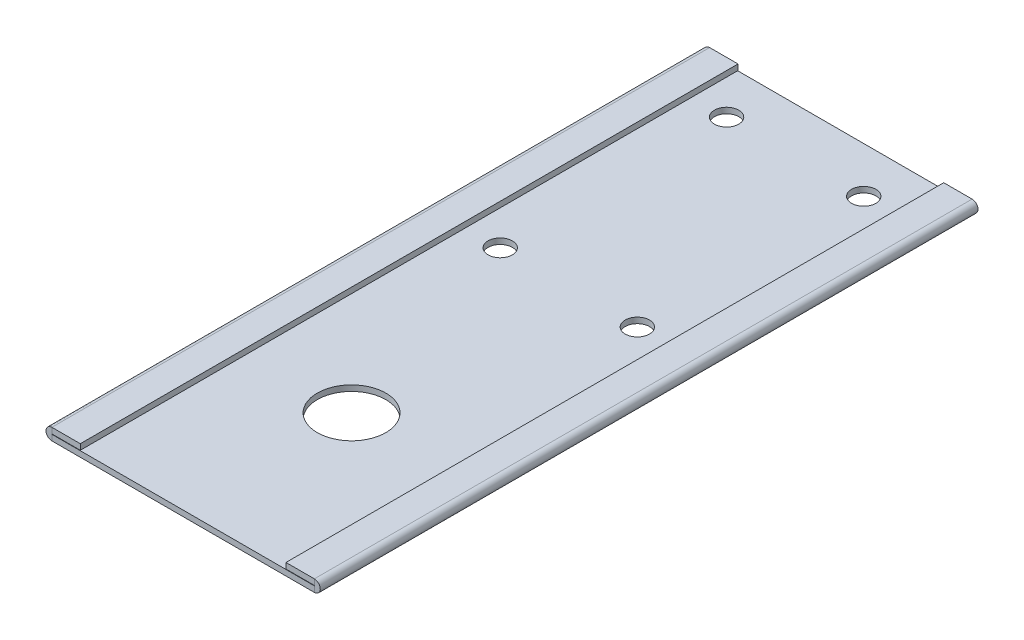
ISO-10303-21;
HEADER;
FILE_DESCRIPTION(('STEP AP214'),'2;1');
FILE_NAME('part.step','',(''),(''),'','','');
FILE_SCHEMA(('AUTOMOTIVE_DESIGN { 1 0 10303 214 1 1 1 1 }'));
ENDSEC;
DATA;
#1=APPLICATION_CONTEXT('core data for automotive mechanical design processes');
#2=APPLICATION_PROTOCOL_DEFINITION('international standard','automotive_design',2000,#1);
#3=PRODUCT_CONTEXT('',#1,'mechanical');
#4=PRODUCT('Part','Part','',(#3));
#5=PRODUCT_RELATED_PRODUCT_CATEGORY('part','',(#4));
#6=PRODUCT_DEFINITION_FORMATION('','',#4);
#7=PRODUCT_DEFINITION_CONTEXT('part definition',#1,'design');
#8=PRODUCT_DEFINITION('design','',#6,#7);
#9=PRODUCT_DEFINITION_SHAPE('','',#8);
#10=(LENGTH_UNIT() NAMED_UNIT(*) SI_UNIT(.MILLI.,.METRE.));
#11=(NAMED_UNIT(*) PLANE_ANGLE_UNIT() SI_UNIT($,.RADIAN.));
#12=(NAMED_UNIT(*) SI_UNIT($,.STERADIAN.) SOLID_ANGLE_UNIT());
#13=UNCERTAINTY_MEASURE_WITH_UNIT(LENGTH_MEASURE(1.E-05),#10,'distance_accuracy_value','');
#14=(GEOMETRIC_REPRESENTATION_CONTEXT(3) GLOBAL_UNCERTAINTY_ASSIGNED_CONTEXT((#13)) GLOBAL_UNIT_ASSIGNED_CONTEXT((#10,
#11,#12)) REPRESENTATION_CONTEXT('',''));
#15=CARTESIAN_POINT('',(0.,0.,0.));
#16=DIRECTION('',(0.,0.,1.));
#17=DIRECTION('',(1.,0.,0.));
#18=AXIS2_PLACEMENT_3D('',#15,#16,#17);
#19=CARTESIAN_POINT('',(0.,-1.5875,-182.7422304));
#20=DIRECTION('',(0.,0.,-1.));
#21=DIRECTION('',(-1.,0.,0.));
#22=AXIS2_PLACEMENT_3D('',#19,#20,#21);
#23=PLANE('',#22);
#24=DIRECTION('',(-1.,0.,0.));
#25=VECTOR('',#24,1.);
#26=CARTESIAN_POINT('',(0.,0.,-182.7422304));
#27=LINE('',#26,#25);
#28=CARTESIAN_POINT('',(-1.63749999999999,0.,-182.7422304));
#29=VERTEX_POINT('',#28);
#30=CARTESIAN_POINT('',(-74.5625,0.,-182.7422304));
#31=VERTEX_POINT('',#30);
#32=EDGE_CURVE('E348',#29,#31,#27,.T.);
#33=ORIENTED_EDGE('',*,*,#32,.F.);
#34=DIRECTION('',(0.,-1.,0.));
#35=VECTOR('',#34,1.);
#36=CARTESIAN_POINT('',(-1.63749999999999,0.,-182.7422304));
#37=LINE('',#36,#35);
#38=CARTESIAN_POINT('',(-1.63749999999999,-1.5875,-182.7422304));
#39=VERTEX_POINT('',#38);
#40=EDGE_CURVE('E63',#29,#39,#37,.T.);
#41=ORIENTED_EDGE('',*,*,#40,.T.);
#42=DIRECTION('',(-1.,0.,0.));
#43=VECTOR('',#42,1.);
#44=CARTESIAN_POINT('',(0.,-1.5875,-182.7422304));
#45=LINE('',#44,#43);
#46=CARTESIAN_POINT('',(-74.5625,-1.5875,-182.7422304));
#47=VERTEX_POINT('',#46);
#48=EDGE_CURVE('E52',#39,#47,#45,.T.);
#49=ORIENTED_EDGE('',*,*,#48,.T.);
#50=DIRECTION('',(0.,-1.,0.));
#51=VECTOR('',#50,1.);
#52=CARTESIAN_POINT('',(-74.5625,0.,-182.7422304));
#53=LINE('',#52,#51);
#54=EDGE_CURVE('E258',#31,#47,#53,.T.);
#55=ORIENTED_EDGE('',*,*,#54,.F.);
#56=EDGE_LOOP('',(#33,#41,#49,#55));
#57=FACE_BOUND('',#56,.T.);
#58=ADVANCED_FACE('F43',(#57),#23,.T.);
#59=CARTESIAN_POINT('',(0.,-1.5875,0.));
#60=DIRECTION('',(0.,0.,1.));
#61=DIRECTION('',(1.,0.,0.));
#62=AXIS2_PLACEMENT_3D('',#59,#60,#61);
#63=PLANE('',#62);
#64=DIRECTION('',(0.,-1.,0.));
#65=VECTOR('',#64,1.);
#66=CARTESIAN_POINT('',(-1.63749999999999,0.,0.));
#67=LINE('',#66,#65);
#68=CARTESIAN_POINT('',(-1.63749999999999,0.,0.));
#69=VERTEX_POINT('',#68);
#70=CARTESIAN_POINT('',(-1.63749999999987,-1.5875,0.));
#71=VERTEX_POINT('',#70);
#72=EDGE_CURVE('E155',#69,#71,#67,.T.);
#73=ORIENTED_EDGE('',*,*,#72,.F.);
#74=DIRECTION('',(1.,0.,0.));
#75=VECTOR('',#74,1.);
#76=CARTESIAN_POINT('',(0.,0.,0.));
#77=LINE('',#76,#75);
#78=CARTESIAN_POINT('',(-74.5625,0.,0.));
#79=VERTEX_POINT('',#78);
#80=EDGE_CURVE('E46',#79,#69,#77,.T.);
#81=ORIENTED_EDGE('',*,*,#80,.F.);
#82=DIRECTION('',(0.,-1.,0.));
#83=VECTOR('',#82,1.);
#84=CARTESIAN_POINT('',(-74.5625,0.,0.));
#85=LINE('',#84,#83);
#86=CARTESIAN_POINT('',(-74.5625,-1.5875,0.));
#87=VERTEX_POINT('',#86);
#88=EDGE_CURVE('E157',#79,#87,#85,.T.);
#89=ORIENTED_EDGE('',*,*,#88,.T.);
#90=DIRECTION('',(1.,0.,0.));
#91=VECTOR('',#90,1.);
#92=CARTESIAN_POINT('',(0.,-1.5875,0.));
#93=LINE('',#92,#91);
#94=EDGE_CURVE('E11',#87,#71,#93,.T.);
#95=ORIENTED_EDGE('',*,*,#94,.T.);
#96=EDGE_LOOP('',(#73,#81,#89,#95));
#97=FACE_BOUND('',#96,.T.);
#98=ADVANCED_FACE('F152',(#97),#63,.T.);
#99=CARTESIAN_POINT('',(0.,-1.5875,0.));
#100=DIRECTION('',(0.,1.,0.));
#101=DIRECTION('',(0.,0.,1.));
#102=AXIS2_PLACEMENT_3D('',#99,#100,#101);
#103=PLANE('',#102);
#104=CARTESIAN_POINT('',(-38.1,-1.5875,-46.7957408));
#105=DIRECTION('',(0.,1.,0.));
#106=DIRECTION('',(0.,0.,1.));
#107=AXIS2_PLACEMENT_3D('',#104,#105,#106);
#108=CIRCLE('',#107,9.525);
#109=CARTESIAN_POINT('',(-38.1,-1.5875,-37.2707408));
#110=VERTEX_POINT('',#109);
#111=EDGE_CURVE('E310',#110,#110,#108,.T.);
#112=ORIENTED_EDGE('',*,*,#111,.T.);
#113=EDGE_LOOP('',(#112));
#114=FACE_BOUND('',#113,.T.);
#115=CARTESIAN_POINT('',(-57.15,-1.5875,-107.14228));
#116=DIRECTION('',(0.,1.,0.));
#117=DIRECTION('',(0.,0.,1.));
#118=AXIS2_PLACEMENT_3D('',#115,#116,#117);
#119=CIRCLE('',#118,3.3782);
#120=CARTESIAN_POINT('',(-57.15,-1.5875,-103.76408));
#121=VERTEX_POINT('',#120);
#122=EDGE_CURVE('E332',#121,#121,#119,.F.);
#123=ORIENTED_EDGE('',*,*,#122,.F.);
#124=EDGE_LOOP('',(#123));
#125=FACE_BOUND('',#124,.T.);
#126=CARTESIAN_POINT('',(-19.05,-1.5875,-107.14228));
#127=DIRECTION('',(0.,1.,0.));
#128=DIRECTION('',(0.,0.,1.));
#129=AXIS2_PLACEMENT_3D('',#126,#127,#128);
#130=CIRCLE('',#129,3.37819999999999);
#131=CARTESIAN_POINT('',(-19.05,-1.5875,-103.76408));
#132=VERTEX_POINT('',#131);
#133=EDGE_CURVE('E323',#132,#132,#130,.F.);
#134=ORIENTED_EDGE('',*,*,#133,.F.);
#135=EDGE_LOOP('',(#134));
#136=FACE_BOUND('',#135,.T.);
#137=CARTESIAN_POINT('',(-19.05,-1.5875,-170.0422304));
#138=DIRECTION('',(0.,1.,0.));
#139=DIRECTION('',(0.,0.,1.));
#140=AXIS2_PLACEMENT_3D('',#137,#138,#139);
#141=CIRCLE('',#140,3.37819999999999);
#142=CARTESIAN_POINT('',(-19.05,-1.5875,-166.6640304));
#143=VERTEX_POINT('',#142);
#144=EDGE_CURVE('E322',#143,#143,#141,.F.);
#145=ORIENTED_EDGE('',*,*,#144,.F.);
#146=EDGE_LOOP('',(#145));
#147=FACE_BOUND('',#146,.T.);
#148=CARTESIAN_POINT('',(-57.15,-1.5875,-170.0422304));
#149=DIRECTION('',(0.,1.,0.));
#150=DIRECTION('',(0.,0.,1.));
#151=AXIS2_PLACEMENT_3D('',#148,#149,#150);
#152=CIRCLE('',#151,3.3782);
#153=CARTESIAN_POINT('',(-57.15,-1.5875,-166.6640304));
#154=VERTEX_POINT('',#153);
#155=EDGE_CURVE('E344',#154,#154,#152,.F.);
#156=ORIENTED_EDGE('',*,*,#155,.F.);
#157=EDGE_LOOP('',(#156));
#158=FACE_BOUND('',#157,.T.);
#159=ORIENTED_EDGE('',*,*,#48,.F.);
#160=DIRECTION('',(0.,0.,-1.));
#161=VECTOR('',#160,1.);
#162=CARTESIAN_POINT('',(-1.63749999999987,-1.5875,-182.7422304));
#163=LINE('',#162,#161);
#164=EDGE_CURVE('E162',#39,#71,#163,.F.);
#165=ORIENTED_EDGE('',*,*,#164,.T.);
#166=ORIENTED_EDGE('',*,*,#94,.F.);
#167=DIRECTION('',(0.,0.,1.));
#168=VECTOR('',#167,1.);
#169=CARTESIAN_POINT('',(-74.5625,-1.5875,0.));
#170=LINE('',#169,#168);
#171=EDGE_CURVE('E236',#87,#47,#170,.F.);
#172=ORIENTED_EDGE('',*,*,#171,.T.);
#173=EDGE_LOOP('',(#159,#165,#166,#172));
#174=FACE_BOUND('',#173,.T.);
#175=ADVANCED_FACE('F163',(#114,#125,#136,#147,#158,#174),#103,.F.);
#176=CARTESIAN_POINT('',(0.,0.,0.));
#177=DIRECTION('',(0.,1.,0.));
#178=DIRECTION('',(0.,0.,1.));
#179=AXIS2_PLACEMENT_3D('',#176,#177,#178);
#180=PLANE('',#179);
#181=DIRECTION('',(0.,0.,-1.));
#182=VECTOR('',#181,1.);
#183=CARTESIAN_POINT('',(-1.63749999999999,0.,-182.7422304));
#184=LINE('',#183,#182);
#185=EDGE_CURVE('E72',#29,#69,#184,.F.);
#186=ORIENTED_EDGE('',*,*,#185,.F.);
#187=ORIENTED_EDGE('',*,*,#32,.T.);
#188=DIRECTION('',(0.,0.,1.));
#189=VECTOR('',#188,1.);
#190=CARTESIAN_POINT('',(-74.5625,0.,0.));
#191=LINE('',#190,#189);
#192=EDGE_CURVE('E251',#79,#31,#191,.F.);
#193=ORIENTED_EDGE('',*,*,#192,.F.);
#194=ORIENTED_EDGE('',*,*,#80,.T.);
#195=EDGE_LOOP('',(#186,#187,#193,#194));
#196=FACE_BOUND('',#195,.T.);
#197=CARTESIAN_POINT('',(-38.1,0.,-46.7957408));
#198=DIRECTION('',(0.,1.,0.));
#199=DIRECTION('',(0.,0.,1.));
#200=AXIS2_PLACEMENT_3D('',#197,#198,#199);
#201=CIRCLE('',#200,9.525);
#202=CARTESIAN_POINT('',(-38.1,0.,-37.2707408));
#203=VERTEX_POINT('',#202);
#204=EDGE_CURVE('E307',#203,#203,#201,.T.);
#205=ORIENTED_EDGE('',*,*,#204,.F.);
#206=EDGE_LOOP('',(#205));
#207=FACE_BOUND('',#206,.T.);
#208=CARTESIAN_POINT('',(-57.15,0.,-107.14228));
#209=DIRECTION('',(0.,1.,0.));
#210=DIRECTION('',(0.,0.,1.));
#211=AXIS2_PLACEMENT_3D('',#208,#209,#210);
#212=CIRCLE('',#211,3.3782);
#213=CARTESIAN_POINT('',(-57.15,0.,-103.76408));
#214=VERTEX_POINT('',#213);
#215=EDGE_CURVE('E314',#214,#214,#212,.T.);
#216=ORIENTED_EDGE('',*,*,#215,.F.);
#217=EDGE_LOOP('',(#216));
#218=FACE_BOUND('',#217,.T.);
#219=CARTESIAN_POINT('',(-19.05,0.,-107.14228));
#220=DIRECTION('',(0.,1.,0.));
#221=DIRECTION('',(0.,0.,1.));
#222=AXIS2_PLACEMENT_3D('',#219,#220,#221);
#223=CIRCLE('',#222,3.37819999999999);
#224=CARTESIAN_POINT('',(-19.05,0.,-103.76408));
#225=VERTEX_POINT('',#224);
#226=EDGE_CURVE('E328',#225,#225,#223,.T.);
#227=ORIENTED_EDGE('',*,*,#226,.F.);
#228=EDGE_LOOP('',(#227));
#229=FACE_BOUND('',#228,.T.);
#230=CARTESIAN_POINT('',(-19.05,0.,-170.0422304));
#231=DIRECTION('',(0.,1.,0.));
#232=DIRECTION('',(0.,0.,1.));
#233=AXIS2_PLACEMENT_3D('',#230,#231,#232);
#234=CIRCLE('',#233,3.37819999999999);
#235=CARTESIAN_POINT('',(-19.05,0.,-166.6640304));
#236=VERTEX_POINT('',#235);
#237=EDGE_CURVE('E318',#236,#236,#234,.T.);
#238=ORIENTED_EDGE('',*,*,#237,.F.);
#239=EDGE_LOOP('',(#238));
#240=FACE_BOUND('',#239,.T.);
#241=CARTESIAN_POINT('',(-57.15,0.,-170.0422304));
#242=DIRECTION('',(0.,1.,0.));
#243=DIRECTION('',(0.,0.,1.));
#244=AXIS2_PLACEMENT_3D('',#241,#242,#243);
#245=CIRCLE('',#244,3.3782);
#246=CARTESIAN_POINT('',(-57.15,0.,-166.6640304));
#247=VERTEX_POINT('',#246);
#248=EDGE_CURVE('E327',#247,#247,#245,.T.);
#249=ORIENTED_EDGE('',*,*,#248,.F.);
#250=EDGE_LOOP('',(#249));
#251=FACE_BOUND('',#250,.T.);
#252=ADVANCED_FACE('F353',(#196,#207,#218,#229,#240,#251),#180,.T.);
#253=CARTESIAN_POINT('',(-57.15,-1.5885,-170.0422304));
#254=DIRECTION('',(0.,1.,0.));
#255=DIRECTION('',(0.,0.,1.));
#256=AXIS2_PLACEMENT_3D('',#253,#254,#255);
#257=CYLINDRICAL_SURFACE('',#256,3.3782);
#258=ORIENTED_EDGE('',*,*,#248,.T.);
#259=EDGE_LOOP('',(#258));
#260=FACE_BOUND('',#259,.T.);
#261=ORIENTED_EDGE('',*,*,#155,.T.);
#262=EDGE_LOOP('',(#261));
#263=FACE_BOUND('',#262,.T.);
#264=ADVANCED_FACE('F532',(#260,#263),#257,.F.);
#265=CARTESIAN_POINT('',(-19.05,-1.5885,-170.0422304));
#266=DIRECTION('',(0.,1.,0.));
#267=DIRECTION('',(0.,0.,1.));
#268=AXIS2_PLACEMENT_3D('',#265,#266,#267);
#269=CYLINDRICAL_SURFACE('',#268,3.37819999999999);
#270=ORIENTED_EDGE('',*,*,#237,.T.);
#271=EDGE_LOOP('',(#270));
#272=FACE_BOUND('',#271,.T.);
#273=ORIENTED_EDGE('',*,*,#144,.T.);
#274=EDGE_LOOP('',(#273));
#275=FACE_BOUND('',#274,.T.);
#276=ADVANCED_FACE('F586',(#272,#275),#269,.F.);
#277=CARTESIAN_POINT('',(-19.05,-1.5885,-107.14228));
#278=DIRECTION('',(0.,1.,0.));
#279=DIRECTION('',(0.,0.,1.));
#280=AXIS2_PLACEMENT_3D('',#277,#278,#279);
#281=CYLINDRICAL_SURFACE('',#280,3.37819999999999);
#282=ORIENTED_EDGE('',*,*,#226,.T.);
#283=EDGE_LOOP('',(#282));
#284=FACE_BOUND('',#283,.T.);
#285=ORIENTED_EDGE('',*,*,#133,.T.);
#286=EDGE_LOOP('',(#285));
#287=FACE_BOUND('',#286,.T.);
#288=ADVANCED_FACE('F575',(#284,#287),#281,.F.);
#289=CARTESIAN_POINT('',(-57.15,-1.5885,-107.14228));
#290=DIRECTION('',(0.,1.,0.));
#291=DIRECTION('',(0.,0.,1.));
#292=AXIS2_PLACEMENT_3D('',#289,#290,#291);
#293=CYLINDRICAL_SURFACE('',#292,3.3782);
#294=ORIENTED_EDGE('',*,*,#215,.T.);
#295=EDGE_LOOP('',(#294));
#296=FACE_BOUND('',#295,.T.);
#297=ORIENTED_EDGE('',*,*,#122,.T.);
#298=EDGE_LOOP('',(#297));
#299=FACE_BOUND('',#298,.T.);
#300=ADVANCED_FACE('F565',(#296,#299),#293,.F.);
#301=CARTESIAN_POINT('',(-38.1,-1.5875,-46.7957408));
#302=DIRECTION('',(0.,1.,0.));
#303=DIRECTION('',(0.,0.,1.));
#304=AXIS2_PLACEMENT_3D('',#301,#302,#303);
#305=CYLINDRICAL_SURFACE('',#304,9.525);
#306=ORIENTED_EDGE('',*,*,#111,.F.);
#307=EDGE_LOOP('',(#306));
#308=FACE_BOUND('',#307,.T.);
#309=ORIENTED_EDGE('',*,*,#204,.T.);
#310=EDGE_LOOP('',(#309));
#311=FACE_BOUND('',#310,.T.);
#312=ADVANCED_FACE('F391',(#308,#311),#305,.F.);
#313=CARTESIAN_POINT('',(-70.61875,1.6875,0.));
#314=DIRECTION('',(0.,0.,-1.));
#315=DIRECTION('',(-1.,0.,0.));
#316=AXIS2_PLACEMENT_3D('',#313,#314,#315);
#317=PLANE('',#316);
#318=DIRECTION('',(0.,1.,0.));
#319=VECTOR('',#318,1.);
#320=CARTESIAN_POINT('',(-74.5625,1.6875,0.));
#321=LINE('',#320,#319);
#322=CARTESIAN_POINT('',(-74.5625,0.1,0.));
#323=VERTEX_POINT('',#322);
#324=CARTESIAN_POINT('',(-74.5625,1.6875,0.));
#325=VERTEX_POINT('',#324);
#326=EDGE_CURVE('E299',#323,#325,#321,.T.);
#327=ORIENTED_EDGE('',*,*,#326,.F.);
#328=DIRECTION('',(1.,0.,0.));
#329=VECTOR('',#328,1.);
#330=CARTESIAN_POINT('',(-70.61875,0.1,0.));
#331=LINE('',#330,#329);
#332=CARTESIAN_POINT('',(-66.675,0.1,0.));
#333=VERTEX_POINT('',#332);
#334=EDGE_CURVE('E286',#333,#323,#331,.F.);
#335=ORIENTED_EDGE('',*,*,#334,.F.);
#336=DIRECTION('',(0.,1.,0.));
#337=VECTOR('',#336,1.);
#338=CARTESIAN_POINT('',(-66.675,1.6875,0.));
#339=LINE('',#338,#337);
#340=CARTESIAN_POINT('',(-66.675,1.6875,0.));
#341=VERTEX_POINT('',#340);
#342=EDGE_CURVE('E296',#333,#341,#339,.T.);
#343=ORIENTED_EDGE('',*,*,#342,.T.);
#344=DIRECTION('',(-1.,0.,0.));
#345=VECTOR('',#344,1.);
#346=CARTESIAN_POINT('',(-70.61875,1.6875,0.));
#347=LINE('',#346,#345);
#348=EDGE_CURVE('E270',#341,#325,#347,.T.);
#349=ORIENTED_EDGE('',*,*,#348,.T.);
#350=EDGE_LOOP('',(#327,#335,#343,#349));
#351=FACE_BOUND('',#350,.T.);
#352=ADVANCED_FACE('F381',(#351),#317,.F.);
#353=CARTESIAN_POINT('',(-66.675,1.6875,-91.3711152));
#354=DIRECTION('',(-1.,0.,0.));
#355=DIRECTION('',(0.,0.,1.));
#356=AXIS2_PLACEMENT_3D('',#353,#354,#355);
#357=PLANE('',#356);
#358=ORIENTED_EDGE('',*,*,#342,.F.);
#359=DIRECTION('',(0.,0.,1.));
#360=VECTOR('',#359,1.);
#361=CARTESIAN_POINT('',(-66.675,0.1,-91.3711152));
#362=LINE('',#361,#360);
#363=CARTESIAN_POINT('',(-66.675,0.1,-182.7422304));
#364=VERTEX_POINT('',#363);
#365=EDGE_CURVE('E282',#364,#333,#362,.T.);
#366=ORIENTED_EDGE('',*,*,#365,.F.);
#367=DIRECTION('',(0.,1.,0.));
#368=VECTOR('',#367,1.);
#369=CARTESIAN_POINT('',(-66.675,1.6875,-182.7422304));
#370=LINE('',#369,#368);
#371=CARTESIAN_POINT('',(-66.675,1.6875,-182.7422304));
#372=VERTEX_POINT('',#371);
#373=EDGE_CURVE('E269',#364,#372,#370,.T.);
#374=ORIENTED_EDGE('',*,*,#373,.T.);
#375=DIRECTION('',(0.,0.,1.));
#376=VECTOR('',#375,1.);
#377=CARTESIAN_POINT('',(-66.675,1.6875,-91.3711152));
#378=LINE('',#377,#376);
#379=EDGE_CURVE('E265',#372,#341,#378,.T.);
#380=ORIENTED_EDGE('',*,*,#379,.T.);
#381=EDGE_LOOP('',(#358,#366,#374,#380));
#382=FACE_BOUND('',#381,.T.);
#383=ADVANCED_FACE('F383',(#382),#357,.F.);
#384=CARTESIAN_POINT('',(-70.61875,1.6875,-182.7422304));
#385=DIRECTION('',(0.,0.,1.));
#386=DIRECTION('',(1.,0.,0.));
#387=AXIS2_PLACEMENT_3D('',#384,#385,#386);
#388=PLANE('',#387);
#389=DIRECTION('',(1.,0.,0.));
#390=VECTOR('',#389,1.);
#391=CARTESIAN_POINT('',(-70.61875,0.1,-182.7422304));
#392=LINE('',#391,#390);
#393=CARTESIAN_POINT('',(-74.5625,0.1,-182.7422304));
#394=VERTEX_POINT('',#393);
#395=EDGE_CURVE('E262',#394,#364,#392,.T.);
#396=ORIENTED_EDGE('',*,*,#395,.F.);
#397=DIRECTION('',(0.,1.,0.));
#398=VECTOR('',#397,1.);
#399=CARTESIAN_POINT('',(-74.5625,1.6875,-182.7422304));
#400=LINE('',#399,#398);
#401=CARTESIAN_POINT('',(-74.5625,1.6875,-182.7422304));
#402=VERTEX_POINT('',#401);
#403=EDGE_CURVE('E303',#394,#402,#400,.T.);
#404=ORIENTED_EDGE('',*,*,#403,.T.);
#405=DIRECTION('',(1.,0.,0.));
#406=VECTOR('',#405,1.);
#407=CARTESIAN_POINT('',(-70.61875,1.6875,-182.7422304));
#408=LINE('',#407,#406);
#409=EDGE_CURVE('E278',#402,#372,#408,.T.);
#410=ORIENTED_EDGE('',*,*,#409,.T.);
#411=ORIENTED_EDGE('',*,*,#373,.F.);
#412=EDGE_LOOP('',(#396,#404,#410,#411));
#413=FACE_BOUND('',#412,.T.);
#414=ADVANCED_FACE('F370',(#413),#388,.F.);
#415=CARTESIAN_POINT('',(-70.61875,1.6875,-91.3711152));
#416=DIRECTION('',(0.,1.,0.));
#417=DIRECTION('',(0.,0.,1.));
#418=AXIS2_PLACEMENT_3D('',#415,#416,#417);
#419=PLANE('',#418);
#420=ORIENTED_EDGE('',*,*,#379,.F.);
#421=ORIENTED_EDGE('',*,*,#409,.F.);
#422=DIRECTION('',(0.,0.,-1.));
#423=VECTOR('',#422,1.);
#424=CARTESIAN_POINT('',(-74.5625,1.6875,-91.3711152));
#425=LINE('',#424,#423);
#426=EDGE_CURVE('E274',#325,#402,#425,.T.);
#427=ORIENTED_EDGE('',*,*,#426,.F.);
#428=ORIENTED_EDGE('',*,*,#348,.F.);
#429=EDGE_LOOP('',(#420,#421,#427,#428));
#430=FACE_BOUND('',#429,.T.);
#431=ADVANCED_FACE('F379',(#430),#419,.T.);
#432=CARTESIAN_POINT('',(-70.61875,0.1,-91.3711152));
#433=DIRECTION('',(0.,1.,0.));
#434=DIRECTION('',(0.,0.,1.));
#435=AXIS2_PLACEMENT_3D('',#432,#433,#434);
#436=PLANE('',#435);
#437=ORIENTED_EDGE('',*,*,#365,.T.);
#438=ORIENTED_EDGE('',*,*,#334,.T.);
#439=DIRECTION('',(0.,0.,1.));
#440=VECTOR('',#439,1.);
#441=CARTESIAN_POINT('',(-74.5625,0.1,-91.3711152));
#442=LINE('',#441,#440);
#443=EDGE_CURVE('E290',#323,#394,#442,.F.);
#444=ORIENTED_EDGE('',*,*,#443,.T.);
#445=ORIENTED_EDGE('',*,*,#395,.T.);
#446=EDGE_LOOP('',(#437,#438,#444,#445));
#447=FACE_BOUND('',#446,.T.);
#448=ADVANCED_FACE('F365',(#447),#436,.F.);
#449=CARTESIAN_POINT('',(-74.5625,0.05,-182.7422304));
#450=DIRECTION('',(0.,0.,-1.));
#451=DIRECTION('',(-1.,0.,0.));
#452=AXIS2_PLACEMENT_3D('',#449,#450,#451);
#453=PLANE('',#452);
#454=ORIENTED_EDGE('',*,*,#403,.F.);
#455=CARTESIAN_POINT('',(-74.5625,0.05,-182.7422304));
#456=DIRECTION('',(0.,0.,1.));
#457=DIRECTION('',(1.,0.,0.));
#458=AXIS2_PLACEMENT_3D('',#455,#456,#457);
#459=CIRCLE('',#458,0.05);
#460=EDGE_CURVE('E247',#31,#394,#459,.F.);
#461=ORIENTED_EDGE('',*,*,#460,.F.);
#462=ORIENTED_EDGE('',*,*,#54,.T.);
#463=CARTESIAN_POINT('',(-74.5625,0.05,-182.7422304));
#464=DIRECTION('',(0.,0.,1.));
#465=DIRECTION('',(1.,0.,0.));
#466=AXIS2_PLACEMENT_3D('',#463,#464,#465);
#467=CIRCLE('',#466,1.6375);
#468=EDGE_CURVE('E239',#47,#402,#467,.F.);
#469=ORIENTED_EDGE('',*,*,#468,.T.);
#470=EDGE_LOOP('',(#454,#461,#462,#469));
#471=FACE_BOUND('',#470,.T.);
#472=ADVANCED_FACE('F372',(#471),#453,.T.);
#473=CARTESIAN_POINT('',(-74.5625,0.05,0.));
#474=DIRECTION('',(0.,0.,-1.));
#475=DIRECTION('',(-1.,0.,0.));
#476=AXIS2_PLACEMENT_3D('',#473,#474,#475);
#477=PLANE('',#476);
#478=CARTESIAN_POINT('',(-74.5625,0.05,0.));
#479=DIRECTION('',(0.,0.,1.));
#480=DIRECTION('',(1.,0.,0.));
#481=AXIS2_PLACEMENT_3D('',#478,#479,#480);
#482=CIRCLE('',#481,0.05);
#483=EDGE_CURVE('E234',#323,#79,#482,.T.);
#484=ORIENTED_EDGE('',*,*,#483,.F.);
#485=ORIENTED_EDGE('',*,*,#326,.T.);
#486=CARTESIAN_POINT('',(-74.5625,0.05,0.));
#487=DIRECTION('',(0.,0.,1.));
#488=DIRECTION('',(1.,0.,0.));
#489=AXIS2_PLACEMENT_3D('',#486,#487,#488);
#490=CIRCLE('',#489,1.6375);
#491=EDGE_CURVE('E240',#325,#87,#490,.T.);
#492=ORIENTED_EDGE('',*,*,#491,.T.);
#493=ORIENTED_EDGE('',*,*,#88,.F.);
#494=EDGE_LOOP('',(#484,#485,#492,#493));
#495=FACE_BOUND('',#494,.T.);
#496=ADVANCED_FACE('F357',(#495),#477,.F.);
#497=CARTESIAN_POINT('',(-74.5625,0.05,0.));
#498=DIRECTION('',(0.,0.,1.));
#499=DIRECTION('',(0.,1.,0.));
#500=AXIS2_PLACEMENT_3D('',#497,#498,#499);
#501=CYLINDRICAL_SURFACE('',#500,1.6375);
#502=ORIENTED_EDGE('',*,*,#171,.F.);
#503=ORIENTED_EDGE('',*,*,#491,.F.);
#504=ORIENTED_EDGE('',*,*,#426,.T.);
#505=ORIENTED_EDGE('',*,*,#468,.F.);
#506=EDGE_LOOP('',(#502,#503,#504,#505));
#507=FACE_BOUND('',#506,.T.);
#508=ADVANCED_FACE('F375',(#507),#501,.T.);
#509=CARTESIAN_POINT('',(-74.5625,0.05,0.));
#510=DIRECTION('',(0.,0.,1.));
#511=DIRECTION('',(0.,1.,0.));
#512=AXIS2_PLACEMENT_3D('',#509,#510,#511);
#513=CYLINDRICAL_SURFACE('',#512,0.05);
#514=ORIENTED_EDGE('',*,*,#192,.T.);
#515=ORIENTED_EDGE('',*,*,#460,.T.);
#516=ORIENTED_EDGE('',*,*,#443,.F.);
#517=ORIENTED_EDGE('',*,*,#483,.T.);
#518=EDGE_LOOP('',(#514,#515,#516,#517));
#519=FACE_BOUND('',#518,.T.);
#520=ADVANCED_FACE('F361',(#519),#513,.F.);
#521=CARTESIAN_POINT('',(-5.58124999999999,1.6875,-182.7422304));
#522=DIRECTION('',(0.,0.,1.));
#523=DIRECTION('',(1.,0.,0.));
#524=AXIS2_PLACEMENT_3D('',#521,#522,#523);
#525=PLANE('',#524);
#526=DIRECTION('',(0.,1.,0.));
#527=VECTOR('',#526,1.);
#528=CARTESIAN_POINT('',(-1.63749999999999,1.6875,-182.7422304));
#529=LINE('',#528,#527);
#530=CARTESIAN_POINT('',(-1.63749999999999,0.1,-182.7422304));
#531=VERTEX_POINT('',#530);
#532=CARTESIAN_POINT('',(-1.63749999999999,1.6875,-182.7422304));
#533=VERTEX_POINT('',#532);
#534=EDGE_CURVE('E227',#531,#533,#529,.T.);
#535=ORIENTED_EDGE('',*,*,#534,.F.);
#536=DIRECTION('',(1.,0.,0.));
#537=VECTOR('',#536,1.);
#538=CARTESIAN_POINT('',(-5.58124999999999,0.1,-182.7422304));
#539=LINE('',#538,#537);
#540=CARTESIAN_POINT('',(-9.52499999999999,0.1,-182.7422304));
#541=VERTEX_POINT('',#540);
#542=EDGE_CURVE('E215',#541,#531,#539,.T.);
#543=ORIENTED_EDGE('',*,*,#542,.F.);
#544=DIRECTION('',(0.,1.,0.));
#545=VECTOR('',#544,1.);
#546=CARTESIAN_POINT('',(-9.52499999999999,1.6875,-182.7422304));
#547=LINE('',#546,#545);
#548=CARTESIAN_POINT('',(-9.52499999999999,1.6875,-182.7422304));
#549=VERTEX_POINT('',#548);
#550=EDGE_CURVE('E224',#541,#549,#547,.T.);
#551=ORIENTED_EDGE('',*,*,#550,.T.);
#552=DIRECTION('',(1.,0.,0.));
#553=VECTOR('',#552,1.);
#554=CARTESIAN_POINT('',(-5.58124999999999,1.6875,-182.7422304));
#555=LINE('',#554,#553);
#556=EDGE_CURVE('E202',#549,#533,#555,.T.);
#557=ORIENTED_EDGE('',*,*,#556,.T.);
#558=EDGE_LOOP('',(#535,#543,#551,#557));
#559=FACE_BOUND('',#558,.T.);
#560=ADVANCED_FACE('F416',(#559),#525,.F.);
#561=CARTESIAN_POINT('',(-9.52499999999999,1.6875,-91.3711152));
#562=DIRECTION('',(1.,0.,0.));
#563=DIRECTION('',(0.,0.,-1.));
#564=AXIS2_PLACEMENT_3D('',#561,#562,#563);
#565=PLANE('',#564);
#566=ORIENTED_EDGE('',*,*,#550,.F.);
#567=DIRECTION('',(0.,0.,1.));
#568=VECTOR('',#567,1.);
#569=CARTESIAN_POINT('',(-9.525,0.1,-91.3711152));
#570=LINE('',#569,#568);
#571=CARTESIAN_POINT('',(-9.525,0.1,0.));
#572=VERTEX_POINT('',#571);
#573=EDGE_CURVE('E211',#572,#541,#570,.F.);
#574=ORIENTED_EDGE('',*,*,#573,.F.);
#575=DIRECTION('',(0.,1.,0.));
#576=VECTOR('',#575,1.);
#577=CARTESIAN_POINT('',(-9.525,1.6875,0.));
#578=LINE('',#577,#576);
#579=CARTESIAN_POINT('',(-9.525,1.6875,0.));
#580=VERTEX_POINT('',#579);
#581=EDGE_CURVE('E201',#572,#580,#578,.T.);
#582=ORIENTED_EDGE('',*,*,#581,.T.);
#583=DIRECTION('',(0.,0.,-1.));
#584=VECTOR('',#583,1.);
#585=CARTESIAN_POINT('',(-9.52499999999999,1.6875,-91.3711152));
#586=LINE('',#585,#584);
#587=EDGE_CURVE('E197',#580,#549,#586,.T.);
#588=ORIENTED_EDGE('',*,*,#587,.T.);
#589=EDGE_LOOP('',(#566,#574,#582,#588));
#590=FACE_BOUND('',#589,.T.);
#591=ADVANCED_FACE('F413',(#590),#565,.F.);
#592=CARTESIAN_POINT('',(-5.58125,1.6875,0.));
#593=DIRECTION('',(0.,0.,-1.));
#594=DIRECTION('',(-1.,0.,0.));
#595=AXIS2_PLACEMENT_3D('',#592,#593,#594);
#596=PLANE('',#595);
#597=DIRECTION('',(1.,0.,0.));
#598=VECTOR('',#597,1.);
#599=CARTESIAN_POINT('',(-5.58124999999999,0.1,0.));
#600=LINE('',#599,#598);
#601=CARTESIAN_POINT('',(-1.6375,0.1,0.));
#602=VERTEX_POINT('',#601);
#603=EDGE_CURVE('E179',#602,#572,#600,.F.);
#604=ORIENTED_EDGE('',*,*,#603,.F.);
#605=DIRECTION('',(0.,1.,0.));
#606=VECTOR('',#605,1.);
#607=CARTESIAN_POINT('',(-1.6375,1.6875,0.));
#608=LINE('',#607,#606);
#609=CARTESIAN_POINT('',(-1.63749999999999,1.6875,0.));
#610=VERTEX_POINT('',#609);
#611=EDGE_CURVE('E231',#602,#610,#608,.T.);
#612=ORIENTED_EDGE('',*,*,#611,.T.);
#613=DIRECTION('',(-1.,0.,0.));
#614=VECTOR('',#613,1.);
#615=CARTESIAN_POINT('',(-5.58125,1.6875,0.));
#616=LINE('',#615,#614);
#617=EDGE_CURVE('E208',#610,#580,#616,.T.);
#618=ORIENTED_EDGE('',*,*,#617,.T.);
#619=ORIENTED_EDGE('',*,*,#581,.F.);
#620=EDGE_LOOP('',(#604,#612,#618,#619));
#621=FACE_BOUND('',#620,.T.);
#622=ADVANCED_FACE('F410',(#621),#596,.F.);
#623=CARTESIAN_POINT('',(-5.58124999999999,1.6875,-91.3711152));
#624=DIRECTION('',(0.,1.,0.));
#625=DIRECTION('',(0.,0.,1.));
#626=AXIS2_PLACEMENT_3D('',#623,#624,#625);
#627=PLANE('',#626);
#628=ORIENTED_EDGE('',*,*,#587,.F.);
#629=ORIENTED_EDGE('',*,*,#617,.F.);
#630=DIRECTION('',(0.,0.,1.));
#631=VECTOR('',#630,1.);
#632=CARTESIAN_POINT('',(-1.63749999999999,1.6875,-91.3711152));
#633=LINE('',#632,#631);
#634=EDGE_CURVE('E183',#533,#610,#633,.T.);
#635=ORIENTED_EDGE('',*,*,#634,.F.);
#636=ORIENTED_EDGE('',*,*,#556,.F.);
#637=EDGE_LOOP('',(#628,#629,#635,#636));
#638=FACE_BOUND('',#637,.T.);
#639=ADVANCED_FACE('F418',(#638),#627,.T.);
#640=CARTESIAN_POINT('',(-5.58124999999999,0.1,-91.3711152));
#641=DIRECTION('',(0.,1.,0.));
#642=DIRECTION('',(0.,0.,1.));
#643=AXIS2_PLACEMENT_3D('',#640,#641,#642);
#644=PLANE('',#643);
#645=ORIENTED_EDGE('',*,*,#573,.T.);
#646=ORIENTED_EDGE('',*,*,#542,.T.);
#647=DIRECTION('',(0.,0.,1.));
#648=VECTOR('',#647,1.);
#649=CARTESIAN_POINT('',(-1.63749999999999,0.1,-91.3711152));
#650=LINE('',#649,#648);
#651=EDGE_CURVE('E219',#531,#602,#650,.T.);
#652=ORIENTED_EDGE('',*,*,#651,.T.);
#653=ORIENTED_EDGE('',*,*,#603,.T.);
#654=EDGE_LOOP('',(#645,#646,#652,#653));
#655=FACE_BOUND('',#654,.T.);
#656=ADVANCED_FACE('F406',(#655),#644,.F.);
#657=CARTESIAN_POINT('',(-1.63749999999999,0.05,0.));
#658=DIRECTION('',(0.,0.,1.));
#659=DIRECTION('',(1.,0.,0.));
#660=AXIS2_PLACEMENT_3D('',#657,#658,#659);
#661=PLANE('',#660);
#662=ORIENTED_EDGE('',*,*,#611,.F.);
#663=CARTESIAN_POINT('',(-1.63749999999999,0.05,0.));
#664=DIRECTION('',(0.,0.,-1.));
#665=DIRECTION('',(-1.,0.,0.));
#666=AXIS2_PLACEMENT_3D('',#663,#664,#665);
#667=CIRCLE('',#666,0.05);
#668=EDGE_CURVE('E178',#69,#602,#667,.F.);
#669=ORIENTED_EDGE('',*,*,#668,.F.);
#670=ORIENTED_EDGE('',*,*,#72,.T.);
#671=CARTESIAN_POINT('',(-1.63749999999999,0.05,0.));
#672=DIRECTION('',(0.,0.,-1.));
#673=DIRECTION('',(-1.,0.,0.));
#674=AXIS2_PLACEMENT_3D('',#671,#672,#673);
#675=CIRCLE('',#674,1.6375);
#676=EDGE_CURVE('E169',#71,#610,#675,.F.);
#677=ORIENTED_EDGE('',*,*,#676,.T.);
#678=EDGE_LOOP('',(#662,#669,#670,#677));
#679=FACE_BOUND('',#678,.T.);
#680=ADVANCED_FACE('F176',(#679),#661,.T.);
#681=CARTESIAN_POINT('',(-1.63749999999999,0.05,-182.7422304));
#682=DIRECTION('',(0.,0.,1.));
#683=DIRECTION('',(1.,0.,0.));
#684=AXIS2_PLACEMENT_3D('',#681,#682,#683);
#685=PLANE('',#684);
#686=CARTESIAN_POINT('',(-1.63749999999999,0.05,-182.7422304));
#687=DIRECTION('',(0.,0.,-1.));
#688=DIRECTION('',(-1.,0.,0.));
#689=AXIS2_PLACEMENT_3D('',#686,#687,#688);
#690=CIRCLE('',#689,0.05);
#691=EDGE_CURVE('E193',#531,#29,#690,.T.);
#692=ORIENTED_EDGE('',*,*,#691,.F.);
#693=ORIENTED_EDGE('',*,*,#534,.T.);
#694=CARTESIAN_POINT('',(-1.63749999999999,0.05,-182.7422304));
#695=DIRECTION('',(0.,0.,-1.));
#696=DIRECTION('',(-1.,0.,0.));
#697=AXIS2_PLACEMENT_3D('',#694,#695,#696);
#698=CIRCLE('',#697,1.6375);
#699=EDGE_CURVE('E170',#533,#39,#698,.T.);
#700=ORIENTED_EDGE('',*,*,#699,.T.);
#701=ORIENTED_EDGE('',*,*,#40,.F.);
#702=EDGE_LOOP('',(#692,#693,#700,#701));
#703=FACE_BOUND('',#702,.T.);
#704=ADVANCED_FACE('F400',(#703),#685,.F.);
#705=CARTESIAN_POINT('',(-1.63749999999999,0.05,-182.7422304));
#706=DIRECTION('',(0.,0.,-1.));
#707=DIRECTION('',(0.,1.,0.));
#708=AXIS2_PLACEMENT_3D('',#705,#706,#707);
#709=CYLINDRICAL_SURFACE('',#708,1.6375);
#710=ORIENTED_EDGE('',*,*,#164,.F.);
#711=ORIENTED_EDGE('',*,*,#699,.F.);
#712=ORIENTED_EDGE('',*,*,#634,.T.);
#713=ORIENTED_EDGE('',*,*,#676,.F.);
#714=EDGE_LOOP('',(#710,#711,#712,#713));
#715=FACE_BOUND('',#714,.T.);
#716=ADVANCED_FACE('F182',(#715),#709,.T.);
#717=CARTESIAN_POINT('',(-1.63749999999999,0.05,-182.7422304));
#718=DIRECTION('',(0.,0.,-1.));
#719=DIRECTION('',(0.,1.,0.));
#720=AXIS2_PLACEMENT_3D('',#717,#718,#719);
#721=CYLINDRICAL_SURFACE('',#720,0.05);
#722=ORIENTED_EDGE('',*,*,#185,.T.);
#723=ORIENTED_EDGE('',*,*,#668,.T.);
#724=ORIENTED_EDGE('',*,*,#651,.F.);
#725=ORIENTED_EDGE('',*,*,#691,.T.);
#726=EDGE_LOOP('',(#722,#723,#724,#725));
#727=FACE_BOUND('',#726,.T.);
#728=ADVANCED_FACE('F403',(#727),#721,.F.);
#729=CLOSED_SHELL('',(#58,#98,#175,#252,#264,#276,#288,#300,#312,#352,#383,#414,#431,#448,#472,
#496,#508,#520,#560,#591,#622,#639,#656,#680,#704,#716,#728));
#730=MANIFOLD_SOLID_BREP('B2',#729);
#731=ADVANCED_BREP_SHAPE_REPRESENTATION('',(#18,#730),#14);
#732=SHAPE_DEFINITION_REPRESENTATION(#9,#731);
ENDSEC;
END-ISO-10303-21;
